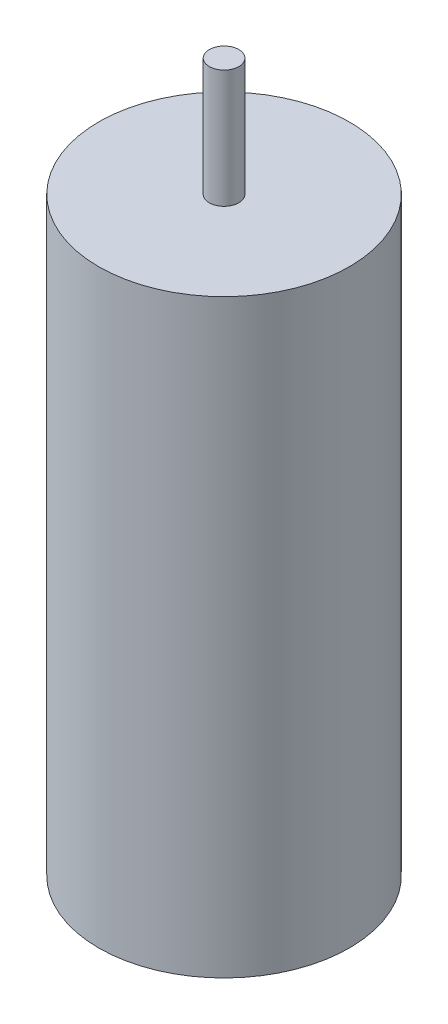
ISO-10303-21;
HEADER;
FILE_DESCRIPTION(('STEP AP214'),'2;1');
FILE_NAME('part.step','',(''),(''),'','','');
FILE_SCHEMA(('AUTOMOTIVE_DESIGN { 1 0 10303 214 1 1 1 1 }'));
ENDSEC;
DATA;
#1=APPLICATION_CONTEXT('core data for automotive mechanical design processes');
#2=APPLICATION_PROTOCOL_DEFINITION('international standard','automotive_design',2000,#1);
#3=PRODUCT_CONTEXT('',#1,'mechanical');
#4=PRODUCT('Part','Part','',(#3));
#5=PRODUCT_RELATED_PRODUCT_CATEGORY('part','',(#4));
#6=PRODUCT_DEFINITION_FORMATION('','',#4);
#7=PRODUCT_DEFINITION_CONTEXT('part definition',#1,'design');
#8=PRODUCT_DEFINITION('design','',#6,#7);
#9=PRODUCT_DEFINITION_SHAPE('','',#8);
#10=(LENGTH_UNIT() NAMED_UNIT(*) SI_UNIT(.MILLI.,.METRE.));
#11=(NAMED_UNIT(*) PLANE_ANGLE_UNIT() SI_UNIT($,.RADIAN.));
#12=(NAMED_UNIT(*) SI_UNIT($,.STERADIAN.) SOLID_ANGLE_UNIT());
#13=UNCERTAINTY_MEASURE_WITH_UNIT(LENGTH_MEASURE(1.E-05),#10,'distance_accuracy_value','');
#14=(GEOMETRIC_REPRESENTATION_CONTEXT(3) GLOBAL_UNCERTAINTY_ASSIGNED_CONTEXT((#13)) GLOBAL_UNIT_ASSIGNED_CONTEXT((#10,
#11,#12)) REPRESENTATION_CONTEXT('',''));
#15=CARTESIAN_POINT('',(0.,0.,0.));
#16=DIRECTION('',(0.,0.,1.));
#17=DIRECTION('',(1.,0.,0.));
#18=AXIS2_PLACEMENT_3D('',#15,#16,#17);
#19=CARTESIAN_POINT('',(0.,20.,0.));
#20=DIRECTION('',(0.,-1.,0.));
#21=DIRECTION('',(0.,0.,-1.));
#22=AXIS2_PLACEMENT_3D('',#19,#20,#21);
#23=CYLINDRICAL_SURFACE('',#22,4.25);
#24=CARTESIAN_POINT('',(0.,20.,0.));
#25=DIRECTION('',(0.,1.,0.));
#26=DIRECTION('',(0.,0.,1.));
#27=AXIS2_PLACEMENT_3D('',#24,#25,#26);
#28=CIRCLE('',#27,4.25);
#29=CARTESIAN_POINT('',(0.,20.,4.25));
#30=VERTEX_POINT('',#29);
#31=EDGE_CURVE('E10',#30,#30,#28,.T.);
#32=ORIENTED_EDGE('',*,*,#31,.F.);
#33=EDGE_LOOP('',(#32));
#34=FACE_BOUND('',#33,.T.);
#35=CARTESIAN_POINT('',(0.,0.,0.));
#36=DIRECTION('',(0.,1.,0.));
#37=DIRECTION('',(0.,0.,1.));
#38=AXIS2_PLACEMENT_3D('',#35,#36,#37);
#39=CIRCLE('',#38,4.25);
#40=CARTESIAN_POINT('',(0.,0.,4.25));
#41=VERTEX_POINT('',#40);
#42=EDGE_CURVE('E33',#41,#41,#39,.T.);
#43=ORIENTED_EDGE('',*,*,#42,.T.);
#44=EDGE_LOOP('',(#43));
#45=FACE_BOUND('',#44,.T.);
#46=ADVANCED_FACE('F30',(#34,#45),#23,.T.);
#47=CARTESIAN_POINT('',(0.,20.,0.));
#48=DIRECTION('',(0.,1.,0.));
#49=DIRECTION('',(0.,0.,1.));
#50=AXIS2_PLACEMENT_3D('',#47,#48,#49);
#51=PLANE('',#50);
#52=CARTESIAN_POINT('',(0.,20.,0.));
#53=DIRECTION('',(0.,1.,0.));
#54=DIRECTION('',(0.,0.,1.));
#55=AXIS2_PLACEMENT_3D('',#52,#53,#54);
#56=CIRCLE('',#55,0.5);
#57=CARTESIAN_POINT('',(0.,20.,0.5));
#58=VERTEX_POINT('',#57);
#59=EDGE_CURVE('E42',#58,#58,#56,.T.);
#60=ORIENTED_EDGE('',*,*,#59,.F.);
#61=EDGE_LOOP('',(#60));
#62=FACE_BOUND('',#61,.T.);
#63=ORIENTED_EDGE('',*,*,#31,.T.);
#64=EDGE_LOOP('',(#63));
#65=FACE_BOUND('',#64,.T.);
#66=ADVANCED_FACE('F57',(#62,#65),#51,.T.);
#67=CARTESIAN_POINT('',(0.,0.,0.));
#68=DIRECTION('',(0.,1.,0.));
#69=DIRECTION('',(0.,0.,1.));
#70=AXIS2_PLACEMENT_3D('',#67,#68,#69);
#71=PLANE('',#70);
#72=ORIENTED_EDGE('',*,*,#42,.F.);
#73=EDGE_LOOP('',(#72));
#74=FACE_BOUND('',#73,.T.);
#75=ADVANCED_FACE('F53',(#74),#71,.F.);
#76=CARTESIAN_POINT('',(0.,24.,0.));
#77=DIRECTION('',(0.,-1.,0.));
#78=DIRECTION('',(0.,0.,-1.));
#79=AXIS2_PLACEMENT_3D('',#76,#77,#78);
#80=CYLINDRICAL_SURFACE('',#79,0.5);
#81=CARTESIAN_POINT('',(0.,24.,0.));
#82=DIRECTION('',(0.,1.,0.));
#83=DIRECTION('',(0.,0.,1.));
#84=AXIS2_PLACEMENT_3D('',#81,#82,#83);
#85=CIRCLE('',#84,0.5);
#86=CARTESIAN_POINT('',(0.,24.,0.5));
#87=VERTEX_POINT('',#86);
#88=EDGE_CURVE('E40',#87,#87,#85,.T.);
#89=ORIENTED_EDGE('',*,*,#88,.F.);
#90=EDGE_LOOP('',(#89));
#91=FACE_BOUND('',#90,.T.);
#92=ORIENTED_EDGE('',*,*,#59,.T.);
#93=EDGE_LOOP('',(#92));
#94=FACE_BOUND('',#93,.T.);
#95=ADVANCED_FACE('F50',(#91,#94),#80,.T.);
#96=CARTESIAN_POINT('',(0.,24.,0.));
#97=DIRECTION('',(0.,1.,0.));
#98=DIRECTION('',(0.,0.,1.));
#99=AXIS2_PLACEMENT_3D('',#96,#97,#98);
#100=PLANE('',#99);
#101=ORIENTED_EDGE('',*,*,#88,.T.);
#102=EDGE_LOOP('',(#101));
#103=FACE_BOUND('',#102,.T.);
#104=ADVANCED_FACE('F48',(#103),#100,.T.);
#105=CLOSED_SHELL('',(#46,#66,#75,#95,#104));
#106=MANIFOLD_SOLID_BREP('B2',#105);
#107=ADVANCED_BREP_SHAPE_REPRESENTATION('',(#18,#106),#14);
#108=SHAPE_DEFINITION_REPRESENTATION(#9,#107);
ENDSEC;
END-ISO-10303-21;
